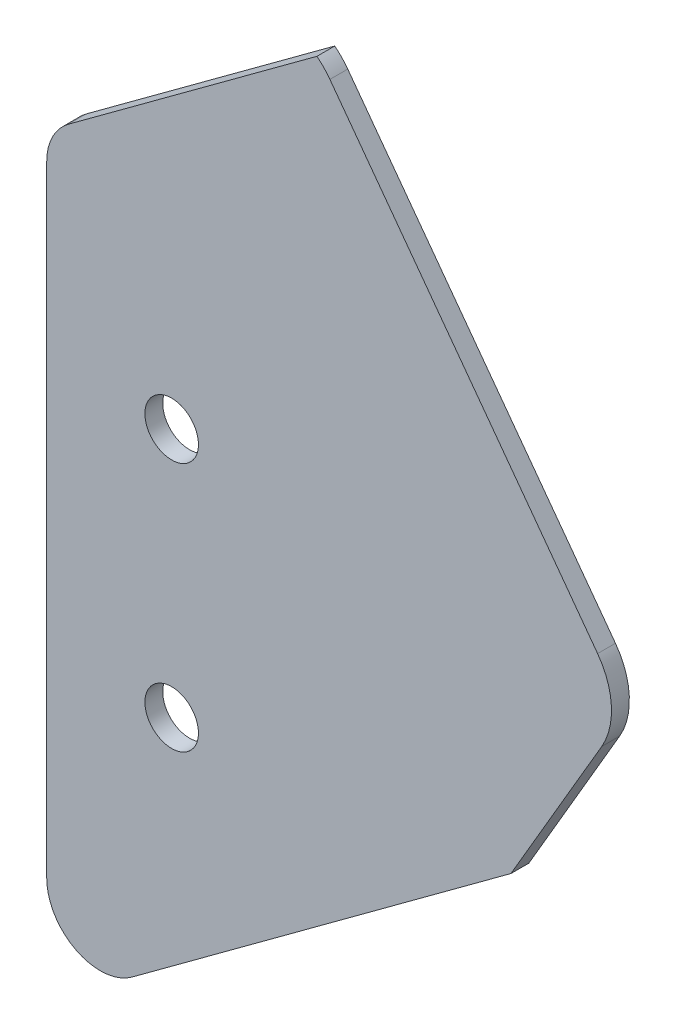
ISO-10303-21;
HEADER;
FILE_DESCRIPTION(('STEP AP214'),'2;1');
FILE_NAME('part.step','',(''),(''),'','','');
FILE_SCHEMA(('AUTOMOTIVE_DESIGN { 1 0 10303 214 1 1 1 1 }'));
ENDSEC;
DATA;
#1=APPLICATION_CONTEXT('core data for automotive mechanical design processes');
#2=APPLICATION_PROTOCOL_DEFINITION('international standard','automotive_design',2000,#1);
#3=PRODUCT_CONTEXT('',#1,'mechanical');
#4=PRODUCT('Part','Part','',(#3));
#5=PRODUCT_RELATED_PRODUCT_CATEGORY('part','',(#4));
#6=PRODUCT_DEFINITION_FORMATION('','',#4);
#7=PRODUCT_DEFINITION_CONTEXT('part definition',#1,'design');
#8=PRODUCT_DEFINITION('design','',#6,#7);
#9=PRODUCT_DEFINITION_SHAPE('','',#8);
#10=(LENGTH_UNIT() NAMED_UNIT(*) SI_UNIT(.MILLI.,.METRE.));
#11=(NAMED_UNIT(*) PLANE_ANGLE_UNIT() SI_UNIT($,.RADIAN.));
#12=(NAMED_UNIT(*) SI_UNIT($,.STERADIAN.) SOLID_ANGLE_UNIT());
#13=UNCERTAINTY_MEASURE_WITH_UNIT(LENGTH_MEASURE(1.E-05),#10,'distance_accuracy_value','');
#14=(GEOMETRIC_REPRESENTATION_CONTEXT(3) GLOBAL_UNCERTAINTY_ASSIGNED_CONTEXT((#13)) GLOBAL_UNIT_ASSIGNED_CONTEXT((#10,
#11,#12)) REPRESENTATION_CONTEXT('',''));
#15=CARTESIAN_POINT('',(0.,0.,0.));
#16=DIRECTION('',(0.,0.,1.));
#17=DIRECTION('',(1.,0.,0.));
#18=AXIS2_PLACEMENT_3D('',#15,#16,#17);
#19=CARTESIAN_POINT('',(-177.829938183927,241.418564799747,3.175));
#20=DIRECTION('',(0.593074905688179,-0.805147288539779,0.));
#21=DIRECTION('',(0.805147288539779,0.593074905688179,0.));
#22=AXIS2_PLACEMENT_3D('',#19,#20,#21);
#23=PLANE('',#22);
#24=DIRECTION('',(-0.805147288539779,-0.593074905688179,0.));
#25=VECTOR('',#24,1.);
#26=CARTESIAN_POINT('',(-177.829938183927,241.418564799747,0.));
#27=LINE('',#26,#25);
#28=CARTESIAN_POINT('',(61.4005319559519,417.636743182071,0.));
#29=VERTEX_POINT('',#28);
#30=CARTESIAN_POINT('',(17.2109615233494,385.086518285645,0.));
#31=VERTEX_POINT('',#30);
#32=EDGE_CURVE('E142',#29,#31,#27,.T.);
#33=ORIENTED_EDGE('',*,*,#32,.T.);
#34=DIRECTION('',(0.,0.,-1.));
#35=VECTOR('',#34,1.);
#36=CARTESIAN_POINT('',(17.2109615233494,385.086518285645,3.175));
#37=LINE('',#36,#35);
#38=CARTESIAN_POINT('',(17.2109615233494,385.086518285645,3.175));
#39=VERTEX_POINT('',#38);
#40=EDGE_CURVE('E11',#39,#31,#37,.T.);
#41=ORIENTED_EDGE('',*,*,#40,.F.);
#42=DIRECTION('',(-0.805147288539779,-0.593074905688179,0.));
#43=VECTOR('',#42,1.);
#44=CARTESIAN_POINT('',(-177.829938183927,241.418564799747,3.175));
#45=LINE('',#44,#43);
#46=CARTESIAN_POINT('',(61.4005319559519,417.636743182071,3.175));
#47=VERTEX_POINT('',#46);
#48=EDGE_CURVE('E199',#47,#39,#45,.T.);
#49=ORIENTED_EDGE('',*,*,#48,.F.);
#50=DIRECTION('',(0.,0.,-1.));
#51=VECTOR('',#50,1.);
#52=CARTESIAN_POINT('',(61.4005319559519,417.636743182071,3.175));
#53=LINE('',#52,#51);
#54=EDGE_CURVE('E132',#47,#29,#53,.T.);
#55=ORIENTED_EDGE('',*,*,#54,.T.);
#56=EDGE_LOOP('',(#33,#41,#49,#55));
#57=FACE_BOUND('',#56,.T.);
#58=ADVANCED_FACE('F35',(#57),#23,.F.);
#59=CARTESIAN_POINT('',(22.8600000000293,377.417490362304,3.175));
#60=DIRECTION('',(0.,0.,-1.));
#61=DIRECTION('',(-1.,0.,0.));
#62=AXIS2_PLACEMENT_3D('',#59,#60,#61);
#63=CYLINDRICAL_SURFACE('',#62,9.52500000000001);
#64=CARTESIAN_POINT('',(22.8600000000293,377.417490362304,0.));
#65=DIRECTION('',(0.,0.,1.));
#66=DIRECTION('',(1.,0.,0.));
#67=AXIS2_PLACEMENT_3D('',#64,#65,#66);
#68=CIRCLE('',#67,9.52500000000001);
#69=CARTESIAN_POINT('',(13.3350000000292,377.417490362304,0.));
#70=VERTEX_POINT('',#69);
#71=EDGE_CURVE('E145',#31,#70,#68,.T.);
#72=ORIENTED_EDGE('',*,*,#71,.T.);
#73=DIRECTION('',(0.,0.,-1.));
#74=VECTOR('',#73,1.);
#75=CARTESIAN_POINT('',(13.3350000000292,377.417490362304,3.175));
#76=LINE('',#75,#74);
#77=CARTESIAN_POINT('',(13.3350000000292,377.417490362304,3.175));
#78=VERTEX_POINT('',#77);
#79=EDGE_CURVE('E44',#78,#70,#76,.T.);
#80=ORIENTED_EDGE('',*,*,#79,.F.);
#81=CARTESIAN_POINT('',(22.8600000000293,377.417490362304,3.175));
#82=DIRECTION('',(0.,0.,1.));
#83=DIRECTION('',(1.,0.,0.));
#84=AXIS2_PLACEMENT_3D('',#81,#82,#83);
#85=CIRCLE('',#84,9.52500000000001);
#86=EDGE_CURVE('E94',#39,#78,#85,.T.);
#87=ORIENTED_EDGE('',*,*,#86,.F.);
#88=ORIENTED_EDGE('',*,*,#40,.T.);
#89=EDGE_LOOP('',(#72,#80,#87,#88));
#90=FACE_BOUND('',#89,.T.);
#91=ADVANCED_FACE('F227',(#90),#63,.T.);
#92=CARTESIAN_POINT('',(13.3350000000213,-2.7969075758601E-13,3.175));
#93=DIRECTION('',(1.,0.,0.));
#94=DIRECTION('',(0.,1.,0.));
#95=AXIS2_PLACEMENT_3D('',#92,#93,#94);
#96=PLANE('',#95);
#97=DIRECTION('',(0.,-1.,0.));
#98=VECTOR('',#97,1.);
#99=CARTESIAN_POINT('',(13.3350000000213,-2.7969075758601E-13,0.));
#100=LINE('',#99,#98);
#101=CARTESIAN_POINT('',(13.3350000000269,267.002909992505,0.));
#102=VERTEX_POINT('',#101);
#103=EDGE_CURVE('E147',#70,#102,#100,.T.);
#104=ORIENTED_EDGE('',*,*,#103,.T.);
#105=DIRECTION('',(0.,0.,-1.));
#106=VECTOR('',#105,1.);
#107=CARTESIAN_POINT('',(13.3350000000269,267.002909992505,3.175));
#108=LINE('',#107,#106);
#109=CARTESIAN_POINT('',(13.3350000000269,267.002909992505,3.175));
#110=VERTEX_POINT('',#109);
#111=EDGE_CURVE('E170',#110,#102,#108,.T.);
#112=ORIENTED_EDGE('',*,*,#111,.F.);
#113=DIRECTION('',(0.,-1.,0.));
#114=VECTOR('',#113,1.);
#115=CARTESIAN_POINT('',(13.3350000000213,-2.7969075758601E-13,3.175));
#116=LINE('',#115,#114);
#117=EDGE_CURVE('E178',#78,#110,#116,.T.);
#118=ORIENTED_EDGE('',*,*,#117,.F.);
#119=ORIENTED_EDGE('',*,*,#79,.T.);
#120=EDGE_LOOP('',(#104,#112,#118,#119));
#121=FACE_BOUND('',#120,.T.);
#122=ADVANCED_FACE('F176',(#121),#96,.F.);
#123=CARTESIAN_POINT('',(22.8600000000269,267.002909992505,3.175));
#124=DIRECTION('',(0.,0.,-1.));
#125=DIRECTION('',(-1.,0.,0.));
#126=AXIS2_PLACEMENT_3D('',#123,#124,#125);
#127=CYLINDRICAL_SURFACE('',#126,9.52500000000002);
#128=CARTESIAN_POINT('',(22.8600000000269,267.002909992505,0.));
#129=DIRECTION('',(0.,0.,1.));
#130=DIRECTION('',(1.,0.,0.));
#131=AXIS2_PLACEMENT_3D('',#128,#129,#130);
#132=CIRCLE('',#131,9.52500000000002);
#133=CARTESIAN_POINT('',(28.5090384767069,259.333882069163,0.));
#134=VERTEX_POINT('',#133);
#135=EDGE_CURVE('E149',#102,#134,#132,.T.);
#136=ORIENTED_EDGE('',*,*,#135,.T.);
#137=DIRECTION('',(0.,0.,-1.));
#138=VECTOR('',#137,1.);
#139=CARTESIAN_POINT('',(28.5090384767069,259.333882069163,3.175));
#140=LINE('',#139,#138);
#141=CARTESIAN_POINT('',(28.5090384767069,259.333882069163,3.175));
#142=VERTEX_POINT('',#141);
#143=EDGE_CURVE('E167',#142,#134,#140,.T.);
#144=ORIENTED_EDGE('',*,*,#143,.F.);
#145=CARTESIAN_POINT('',(22.8600000000269,267.002909992505,3.175));
#146=DIRECTION('',(0.,0.,1.));
#147=DIRECTION('',(1.,0.,0.));
#148=AXIS2_PLACEMENT_3D('',#145,#146,#147);
#149=CIRCLE('',#148,9.52500000000002);
#150=EDGE_CURVE('E193',#110,#142,#149,.T.);
#151=ORIENTED_EDGE('',*,*,#150,.F.);
#152=ORIENTED_EDGE('',*,*,#111,.T.);
#153=EDGE_LOOP('',(#136,#144,#151,#152));
#154=FACE_BOUND('',#153,.T.);
#155=ADVANCED_FACE('F186',(#154),#127,.T.);
#156=CARTESIAN_POINT('',(-113.807502114888,154.502915001877,3.175));
#157=DIRECTION('',(-0.593074905688179,0.805147288539779,0.));
#158=DIRECTION('',(-0.805147288539779,-0.593074905688179,0.));
#159=AXIS2_PLACEMENT_3D('',#156,#157,#158);
#160=PLANE('',#159);
#161=DIRECTION('',(0.805147288539779,0.593074905688179,0.));
#162=VECTOR('',#161,1.);
#163=CARTESIAN_POINT('',(-113.807502114888,154.502915001877,0.));
#164=LINE('',#163,#162);
#165=CARTESIAN_POINT('',(95.9084346104475,308.980562961492,0.));
#166=VERTEX_POINT('',#165);
#167=EDGE_CURVE('E151',#134,#166,#164,.T.);
#168=ORIENTED_EDGE('',*,*,#167,.T.);
#169=DIRECTION('',(0.,0.,-1.));
#170=VECTOR('',#169,1.);
#171=CARTESIAN_POINT('',(95.9084346104475,308.980562961492,3.175));
#172=LINE('',#171,#170);
#173=CARTESIAN_POINT('',(95.9084346104475,308.980562961492,3.175));
#174=VERTEX_POINT('',#173);
#175=EDGE_CURVE('E165',#174,#166,#172,.T.);
#176=ORIENTED_EDGE('',*,*,#175,.F.);
#177=DIRECTION('',(0.805147288539779,0.593074905688179,0.));
#178=VECTOR('',#177,1.);
#179=CARTESIAN_POINT('',(-113.807502114888,154.502915001877,3.175));
#180=LINE('',#179,#178);
#181=EDGE_CURVE('E192',#142,#174,#180,.T.);
#182=ORIENTED_EDGE('',*,*,#181,.F.);
#183=ORIENTED_EDGE('',*,*,#143,.T.);
#184=EDGE_LOOP('',(#168,#176,#182,#183));
#185=FACE_BOUND('',#184,.T.);
#186=ADVANCED_FACE('F190',(#185),#160,.F.);
#187=CARTESIAN_POINT('',(-63.0827316515713,36.8567403637548,3.175));
#188=DIRECTION('',(0.863430318721118,-0.504468120611351,0.));
#189=DIRECTION('',(0.504468120611351,0.863430318721118,0.));
#190=AXIS2_PLACEMENT_3D('',#187,#188,#189);
#191=PLANE('',#190);
#192=DIRECTION('',(-0.504468120611351,-0.863430318721118,0.));
#193=VECTOR('',#192,1.);
#194=CARTESIAN_POINT('',(-63.0827316515713,36.8567403637548,0.));
#195=LINE('',#194,#193);
#196=CARTESIAN_POINT('',(112.073002649114,336.647282746878,0.));
#197=VERTEX_POINT('',#196);
#198=EDGE_CURVE('E154',#197,#166,#195,.T.);
#199=ORIENTED_EDGE('',*,*,#198,.F.);
#200=DIRECTION('',(0.,0.,-1.));
#201=VECTOR('',#200,1.);
#202=CARTESIAN_POINT('',(112.073002649114,336.647282746878,3.175));
#203=LINE('',#202,#201);
#204=CARTESIAN_POINT('',(112.073002649114,336.647282746878,3.175));
#205=VERTEX_POINT('',#204);
#206=EDGE_CURVE('E128',#205,#197,#203,.T.);
#207=ORIENTED_EDGE('',*,*,#206,.F.);
#208=DIRECTION('',(-0.504468120611351,-0.863430318721118,0.));
#209=VECTOR('',#208,1.);
#210=CARTESIAN_POINT('',(-63.0827316515713,36.8567403637548,3.175));
#211=LINE('',#210,#209);
#212=EDGE_CURVE('E117',#205,#174,#211,.T.);
#213=ORIENTED_EDGE('',*,*,#212,.T.);
#214=ORIENTED_EDGE('',*,*,#175,.T.);
#215=EDGE_LOOP('',(#199,#207,#213,#214));
#216=FACE_BOUND('',#215,.T.);
#217=ADVANCED_FACE('F241',(#216),#191,.T.);
#218=CARTESIAN_POINT('',(101.107437601355,343.054027878642,3.175));
#219=DIRECTION('',(0.,0.,-1.));
#220=DIRECTION('',(-1.,0.,0.));
#221=AXIS2_PLACEMENT_3D('',#218,#219,#220);
#222=CYLINDRICAL_SURFACE('',#221,12.7);
#223=CARTESIAN_POINT('',(101.107437601355,343.054027878642,0.));
#224=DIRECTION('',(0.,0.,1.));
#225=DIRECTION('',(1.,0.,0.));
#226=AXIS2_PLACEMENT_3D('',#223,#224,#225);
#227=CIRCLE('',#226,12.7);
#228=CARTESIAN_POINT('',(111.33280816581,350.586079180882,0.));
#229=VERTEX_POINT('',#228);
#230=EDGE_CURVE('E124',#197,#229,#227,.T.);
#231=ORIENTED_EDGE('',*,*,#230,.T.);
#232=DIRECTION('',(0.,0.,-1.));
#233=VECTOR('',#232,1.);
#234=CARTESIAN_POINT('',(111.33280816581,350.586079180882,3.175));
#235=LINE('',#234,#233);
#236=CARTESIAN_POINT('',(111.33280816581,350.586079180882,3.175));
#237=VERTEX_POINT('',#236);
#238=EDGE_CURVE('E121',#237,#229,#235,.T.);
#239=ORIENTED_EDGE('',*,*,#238,.F.);
#240=CARTESIAN_POINT('',(101.107437601355,343.054027878642,3.175));
#241=DIRECTION('',(0.,0.,1.));
#242=DIRECTION('',(1.,0.,0.));
#243=AXIS2_PLACEMENT_3D('',#240,#241,#242);
#244=CIRCLE('',#243,12.7);
#245=EDGE_CURVE('E111',#205,#237,#244,.T.);
#246=ORIENTED_EDGE('',*,*,#245,.F.);
#247=ORIENTED_EDGE('',*,*,#206,.T.);
#248=EDGE_LOOP('',(#231,#239,#246,#247));
#249=FACE_BOUND('',#248,.T.);
#250=ADVANCED_FACE('F122',(#249),#222,.T.);
#251=CARTESIAN_POINT('',(239.582134781761,176.477216048207,3.175));
#252=DIRECTION('',(0.805147288539785,0.59307490568817,0.));
#253=DIRECTION('',(-0.59307490568817,0.805147288539785,0.));
#254=AXIS2_PLACEMENT_3D('',#251,#252,#253);
#255=PLANE('',#254);
#256=DIRECTION('',(0.59307490568817,-0.805147288539785,0.));
#257=VECTOR('',#256,1.);
#258=CARTESIAN_POINT('',(239.582134781761,176.477216048207,0.));
#259=LINE('',#258,#257);
#260=CARTESIAN_POINT('',(63.7105299364164,415.237184501201,0.));
#261=VERTEX_POINT('',#260);
#262=EDGE_CURVE('E158',#261,#229,#259,.T.);
#263=ORIENTED_EDGE('',*,*,#262,.F.);
#264=DIRECTION('',(0.,0.,-1.));
#265=VECTOR('',#264,1.);
#266=CARTESIAN_POINT('',(63.7105299364164,415.237184501201,3.175));
#267=LINE('',#266,#265);
#268=CARTESIAN_POINT('',(63.7105299364164,415.237184501201,3.175));
#269=VERTEX_POINT('',#268);
#270=EDGE_CURVE('E83',#269,#261,#267,.T.);
#271=ORIENTED_EDGE('',*,*,#270,.F.);
#272=DIRECTION('',(0.59307490568817,-0.805147288539785,0.));
#273=VECTOR('',#272,1.);
#274=CARTESIAN_POINT('',(239.582134781761,176.477216048207,3.175));
#275=LINE('',#274,#273);
#276=EDGE_CURVE('E115',#269,#237,#275,.T.);
#277=ORIENTED_EDGE('',*,*,#276,.T.);
#278=ORIENTED_EDGE('',*,*,#238,.T.);
#279=EDGE_LOOP('',(#263,#271,#277,#278));
#280=FACE_BOUND('',#279,.T.);
#281=ADVANCED_FACE('F130',(#280),#255,.T.);
#282=CARTESIAN_POINT('',(35.5600000000281,302.837639338046,3.175));
#283=DIRECTION('',(0.,0.,-1.));
#284=DIRECTION('',(-1.,0.,0.));
#285=AXIS2_PLACEMENT_3D('',#282,#283,#284);
#286=CYLINDRICAL_SURFACE('',#285,4.76249999999627);
#287=CARTESIAN_POINT('',(35.5600000000281,302.837639338046,3.175));
#288=DIRECTION('',(0.,0.,1.));
#289=DIRECTION('',(1.,0.,0.));
#290=AXIS2_PLACEMENT_3D('',#287,#288,#289);
#291=CIRCLE('',#290,4.76249999999627);
#292=CARTESIAN_POINT('',(40.3225000000244,302.837639338046,3.175));
#293=VERTEX_POINT('',#292);
#294=EDGE_CURVE('E201',#293,#293,#291,.T.);
#295=ORIENTED_EDGE('',*,*,#294,.T.);
#296=EDGE_LOOP('',(#295));
#297=FACE_BOUND('',#296,.T.);
#298=CARTESIAN_POINT('',(35.5600000000281,302.837639338046,0.));
#299=DIRECTION('',(0.,0.,1.));
#300=DIRECTION('',(1.,0.,0.));
#301=AXIS2_PLACEMENT_3D('',#298,#299,#300);
#302=CIRCLE('',#301,4.76249999999627);
#303=CARTESIAN_POINT('',(40.3225000000244,302.837639338046,0.));
#304=VERTEX_POINT('',#303);
#305=EDGE_CURVE('E139',#304,#304,#302,.T.);
#306=ORIENTED_EDGE('',*,*,#305,.F.);
#307=EDGE_LOOP('',(#306));
#308=FACE_BOUND('',#307,.T.);
#309=ADVANCED_FACE('F215',(#297,#308),#286,.F.);
#310=CARTESIAN_POINT('',(35.5600000000289,347.287639338046,3.175));
#311=DIRECTION('',(0.,0.,-1.));
#312=DIRECTION('',(-1.,0.,0.));
#313=AXIS2_PLACEMENT_3D('',#310,#311,#312);
#314=CYLINDRICAL_SURFACE('',#313,4.7625000000069);
#315=CARTESIAN_POINT('',(35.5600000000289,347.287639338046,3.175));
#316=DIRECTION('',(0.,0.,1.));
#317=DIRECTION('',(1.,0.,0.));
#318=AXIS2_PLACEMENT_3D('',#315,#316,#317);
#319=CIRCLE('',#318,4.7625000000069);
#320=CARTESIAN_POINT('',(40.3225000000358,347.287639338046,3.175));
#321=VERTEX_POINT('',#320);
#322=EDGE_CURVE('E161',#321,#321,#319,.T.);
#323=ORIENTED_EDGE('',*,*,#322,.T.);
#324=EDGE_LOOP('',(#323));
#325=FACE_BOUND('',#324,.T.);
#326=CARTESIAN_POINT('',(35.5600000000289,347.287639338046,0.));
#327=DIRECTION('',(0.,0.,1.));
#328=DIRECTION('',(1.,0.,0.));
#329=AXIS2_PLACEMENT_3D('',#326,#327,#328);
#330=CIRCLE('',#329,4.7625000000069);
#331=CARTESIAN_POINT('',(40.3225000000358,347.287639338046,0.));
#332=VERTEX_POINT('',#331);
#333=EDGE_CURVE('E136',#332,#332,#330,.T.);
#334=ORIENTED_EDGE('',*,*,#333,.F.);
#335=EDGE_LOOP('',(#334));
#336=FACE_BOUND('',#335,.T.);
#337=ADVANCED_FACE('F37',(#325,#336),#314,.F.);
#338=CARTESIAN_POINT('',(53.485159371961,407.705133198961,3.175));
#339=DIRECTION('',(0.,0.,-1.));
#340=DIRECTION('',(-1.,0.,0.));
#341=AXIS2_PLACEMENT_3D('',#338,#339,#340);
#342=CYLINDRICAL_SURFACE('',#341,12.7);
#343=CARTESIAN_POINT('',(53.485159371961,407.705133198961,0.));
#344=DIRECTION('',(0.,0.,1.));
#345=DIRECTION('',(1.,0.,0.));
#346=AXIS2_PLACEMENT_3D('',#343,#344,#345);
#347=CIRCLE('',#346,12.7);
#348=EDGE_CURVE('E86',#261,#29,#347,.T.);
#349=ORIENTED_EDGE('',*,*,#348,.T.);
#350=ORIENTED_EDGE('',*,*,#54,.F.);
#351=CARTESIAN_POINT('',(53.485159371961,407.705133198961,3.175));
#352=DIRECTION('',(0.,0.,1.));
#353=DIRECTION('',(1.,0.,0.));
#354=AXIS2_PLACEMENT_3D('',#351,#352,#353);
#355=CIRCLE('',#354,12.7);
#356=EDGE_CURVE('E52',#269,#47,#355,.T.);
#357=ORIENTED_EDGE('',*,*,#356,.F.);
#358=ORIENTED_EDGE('',*,*,#270,.T.);
#359=EDGE_LOOP('',(#349,#350,#357,#358));
#360=FACE_BOUND('',#359,.T.);
#361=ADVANCED_FACE('F211',(#360),#342,.T.);
#362=CARTESIAN_POINT('',(0.,0.,3.175));
#363=DIRECTION('',(0.,0.,1.));
#364=DIRECTION('',(1.,0.,0.));
#365=AXIS2_PLACEMENT_3D('',#362,#363,#364);
#366=PLANE('',#365);
#367=ORIENTED_EDGE('',*,*,#322,.F.);
#368=EDGE_LOOP('',(#367));
#369=FACE_BOUND('',#368,.T.);
#370=ORIENTED_EDGE('',*,*,#294,.F.);
#371=EDGE_LOOP('',(#370));
#372=FACE_BOUND('',#371,.T.);
#373=ORIENTED_EDGE('',*,*,#48,.T.);
#374=ORIENTED_EDGE('',*,*,#86,.T.);
#375=ORIENTED_EDGE('',*,*,#117,.T.);
#376=ORIENTED_EDGE('',*,*,#150,.T.);
#377=ORIENTED_EDGE('',*,*,#181,.T.);
#378=ORIENTED_EDGE('',*,*,#212,.F.);
#379=ORIENTED_EDGE('',*,*,#245,.T.);
#380=ORIENTED_EDGE('',*,*,#276,.F.);
#381=ORIENTED_EDGE('',*,*,#356,.T.);
#382=EDGE_LOOP('',(#373,#374,#375,#376,#377,#378,#379,#380,#381));
#383=FACE_BOUND('',#382,.T.);
#384=ADVANCED_FACE('F113',(#369,#372,#383),#366,.T.);
#385=CARTESIAN_POINT('',(0.,0.,0.));
#386=DIRECTION('',(0.,0.,1.));
#387=DIRECTION('',(1.,0.,0.));
#388=AXIS2_PLACEMENT_3D('',#385,#386,#387);
#389=PLANE('',#388);
#390=ORIENTED_EDGE('',*,*,#333,.T.);
#391=EDGE_LOOP('',(#390));
#392=FACE_BOUND('',#391,.T.);
#393=ORIENTED_EDGE('',*,*,#305,.T.);
#394=EDGE_LOOP('',(#393));
#395=FACE_BOUND('',#394,.T.);
#396=ORIENTED_EDGE('',*,*,#32,.F.);
#397=ORIENTED_EDGE('',*,*,#348,.F.);
#398=ORIENTED_EDGE('',*,*,#262,.T.);
#399=ORIENTED_EDGE('',*,*,#230,.F.);
#400=ORIENTED_EDGE('',*,*,#198,.T.);
#401=ORIENTED_EDGE('',*,*,#167,.F.);
#402=ORIENTED_EDGE('',*,*,#135,.F.);
#403=ORIENTED_EDGE('',*,*,#103,.F.);
#404=ORIENTED_EDGE('',*,*,#71,.F.);
#405=EDGE_LOOP('',(#396,#397,#398,#399,#400,#401,#402,#403,#404));
#406=FACE_BOUND('',#405,.T.);
#407=ADVANCED_FACE('F182',(#392,#395,#406),#389,.F.);
#408=CLOSED_SHELL('',(#58,#91,#122,#155,#186,#217,#250,#281,#309,#337,#361,#384,#407));
#409=MANIFOLD_SOLID_BREP('B2',#408);
#410=ADVANCED_BREP_SHAPE_REPRESENTATION('',(#18,#409),#14);
#411=SHAPE_DEFINITION_REPRESENTATION(#9,#410);
ENDSEC;
END-ISO-10303-21;
